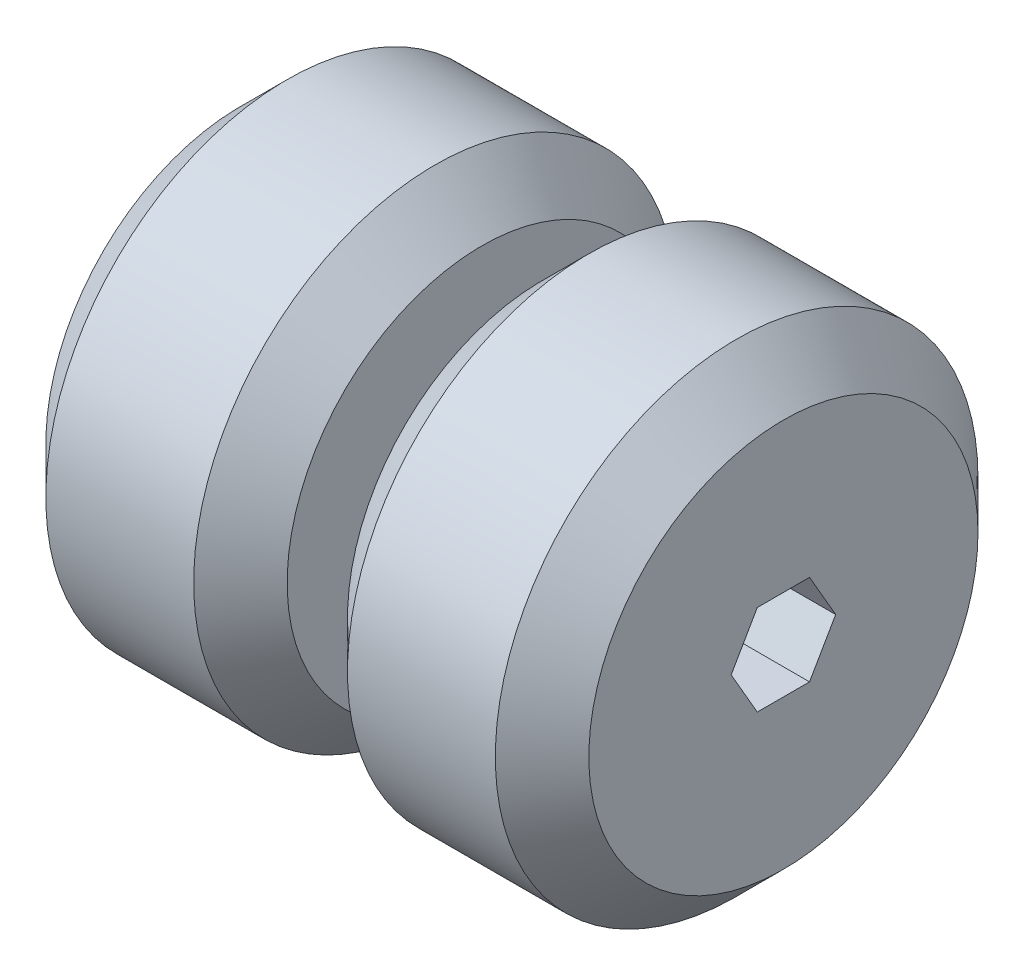
ISO-10303-21;
HEADER;
FILE_DESCRIPTION(('STEP AP214'),'2;1');
FILE_NAME('part.step','',(''),(''),'','','');
FILE_SCHEMA(('AUTOMOTIVE_DESIGN { 1 0 10303 214 1 1 1 1 }'));
ENDSEC;
DATA;
#1=APPLICATION_CONTEXT('core data for automotive mechanical design processes');
#2=APPLICATION_PROTOCOL_DEFINITION('international standard','automotive_design',2000,#1);
#3=PRODUCT_CONTEXT('',#1,'mechanical');
#4=PRODUCT('Part','Part','',(#3));
#5=PRODUCT_RELATED_PRODUCT_CATEGORY('part','',(#4));
#6=PRODUCT_DEFINITION_FORMATION('','',#4);
#7=PRODUCT_DEFINITION_CONTEXT('part definition',#1,'design');
#8=PRODUCT_DEFINITION('design','',#6,#7);
#9=PRODUCT_DEFINITION_SHAPE('','',#8);
#10=(LENGTH_UNIT() NAMED_UNIT(*) SI_UNIT(.MILLI.,.METRE.));
#11=(NAMED_UNIT(*) PLANE_ANGLE_UNIT() SI_UNIT($,.RADIAN.));
#12=(NAMED_UNIT(*) SI_UNIT($,.STERADIAN.) SOLID_ANGLE_UNIT());
#13=UNCERTAINTY_MEASURE_WITH_UNIT(LENGTH_MEASURE(1.E-05),#10,'distance_accuracy_value','');
#14=(GEOMETRIC_REPRESENTATION_CONTEXT(3) GLOBAL_UNCERTAINTY_ASSIGNED_CONTEXT((#13)) GLOBAL_UNIT_ASSIGNED_CONTEXT((#10,
#11,#12)) REPRESENTATION_CONTEXT('',''));
#15=CARTESIAN_POINT('',(0.,0.,0.));
#16=DIRECTION('',(0.,0.,1.));
#17=DIRECTION('',(1.,0.,0.));
#18=AXIS2_PLACEMENT_3D('',#15,#16,#17);
#19=CARTESIAN_POINT('',(-28.575,0.,0.));
#20=DIRECTION('',(1.,0.,0.));
#21=DIRECTION('',(0.,0.,-1.));
#22=AXIS2_PLACEMENT_3D('',#19,#20,#21);
#23=CYLINDRICAL_SURFACE('',#22,25.4);
#24=CARTESIAN_POINT('',(-8.09500000000002,0.,0.));
#25=DIRECTION('',(1.,0.,0.));
#26=DIRECTION('',(0.,0.,-1.));
#27=AXIS2_PLACEMENT_3D('',#24,#25,#26);
#28=CIRCLE('',#27,25.4);
#29=CARTESIAN_POINT('',(-8.09500000000002,0.,-25.4));
#30=VERTEX_POINT('',#29);
#31=EDGE_CURVE('E162',#30,#30,#28,.F.);
#32=ORIENTED_EDGE('',*,*,#31,.T.);
#33=EDGE_LOOP('',(#32));
#34=FACE_BOUND('',#33,.T.);
#35=CARTESIAN_POINT('',(-23.655,0.,0.));
#36=DIRECTION('',(1.,0.,0.));
#37=DIRECTION('',(0.,0.,-1.));
#38=AXIS2_PLACEMENT_3D('',#35,#36,#37);
#39=CIRCLE('',#38,25.4);
#40=CARTESIAN_POINT('',(-23.655,0.,-25.4));
#41=VERTEX_POINT('',#40);
#42=EDGE_CURVE('E160',#41,#41,#39,.T.);
#43=ORIENTED_EDGE('',*,*,#42,.T.);
#44=EDGE_LOOP('',(#43));
#45=FACE_BOUND('',#44,.T.);
#46=ADVANCED_FACE('F36',(#34,#45),#23,.T.);
#47=CARTESIAN_POINT('',(-28.575,0.,0.));
#48=DIRECTION('',(1.,0.,0.));
#49=DIRECTION('',(0.,0.,-1.));
#50=AXIS2_PLACEMENT_3D('',#47,#48,#49);
#51=PLANE('',#50);
#52=DIRECTION('',(0.,-0.866025403784439,-0.5));
#53=VECTOR('',#52,1.);
#54=CARTESIAN_POINT('',(-28.575,0.,5.49926131403119));
#55=LINE('',#54,#53);
#56=CARTESIAN_POINT('',(-28.575,0.,5.49926131403119));
#57=VERTEX_POINT('',#56);
#58=CARTESIAN_POINT('',(-28.575,-4.7625,2.74963065701559));
#59=VERTEX_POINT('',#58);
#60=EDGE_CURVE('E98',#57,#59,#55,.T.);
#61=ORIENTED_EDGE('',*,*,#60,.T.);
#62=DIRECTION('',(0.,0.,-1.));
#63=VECTOR('',#62,1.);
#64=CARTESIAN_POINT('',(-28.575,-4.7625,2.74963065701559));
#65=LINE('',#64,#63);
#66=CARTESIAN_POINT('',(-28.575,-4.7625,-2.74963065701559));
#67=VERTEX_POINT('',#66);
#68=EDGE_CURVE('E92',#59,#67,#65,.T.);
#69=ORIENTED_EDGE('',*,*,#68,.T.);
#70=DIRECTION('',(0.,0.866025403784439,-0.5));
#71=VECTOR('',#70,1.);
#72=CARTESIAN_POINT('',(-28.575,-4.7625,-2.74963065701559));
#73=LINE('',#72,#71);
#74=CARTESIAN_POINT('',(-28.575,0.,-5.49926131403118));
#75=VERTEX_POINT('',#74);
#76=EDGE_CURVE('E101',#67,#75,#73,.T.);
#77=ORIENTED_EDGE('',*,*,#76,.T.);
#78=DIRECTION('',(0.,0.866025403784438,0.5));
#79=VECTOR('',#78,1.);
#80=CARTESIAN_POINT('',(-28.575,0.,-5.49926131403118));
#81=LINE('',#80,#79);
#82=CARTESIAN_POINT('',(-28.575,4.7625,-2.74963065701559));
#83=VERTEX_POINT('',#82);
#84=EDGE_CURVE('E52',#75,#83,#81,.T.);
#85=ORIENTED_EDGE('',*,*,#84,.T.);
#86=DIRECTION('',(0.,0.,1.));
#87=VECTOR('',#86,1.);
#88=CARTESIAN_POINT('',(-28.575,4.7625,-2.74963065701559));
#89=LINE('',#88,#87);
#90=CARTESIAN_POINT('',(-28.575,4.7625,2.74963065701559));
#91=VERTEX_POINT('',#90);
#92=EDGE_CURVE('E116',#83,#91,#89,.T.);
#93=ORIENTED_EDGE('',*,*,#92,.T.);
#94=DIRECTION('',(0.,-0.866025403784439,0.5));
#95=VECTOR('',#94,1.);
#96=CARTESIAN_POINT('',(-28.575,4.7625,2.74963065701559));
#97=LINE('',#96,#95);
#98=EDGE_CURVE('E119',#91,#57,#97,.T.);
#99=ORIENTED_EDGE('',*,*,#98,.T.);
#100=EDGE_LOOP('',(#61,#69,#77,#85,#93,#99));
#101=FACE_BOUND('',#100,.T.);
#102=CARTESIAN_POINT('',(-28.575,0.,0.));
#103=DIRECTION('',(1.,0.,0.));
#104=DIRECTION('',(0.,0.,-1.));
#105=AXIS2_PLACEMENT_3D('',#102,#103,#104);
#106=CIRCLE('',#105,20.48);
#107=CARTESIAN_POINT('',(-28.575,0.,-20.48));
#108=VERTEX_POINT('',#107);
#109=EDGE_CURVE('E40',#108,#108,#106,.F.);
#110=ORIENTED_EDGE('',*,*,#109,.T.);
#111=EDGE_LOOP('',(#110));
#112=FACE_BOUND('',#111,.T.);
#113=ADVANCED_FACE('F105',(#101,#112),#51,.F.);
#114=CARTESIAN_POINT('',(-3.175,0.,0.));
#115=DIRECTION('',(1.,0.,0.));
#116=DIRECTION('',(0.,0.,-1.));
#117=AXIS2_PLACEMENT_3D('',#114,#115,#116);
#118=PLANE('',#117);
#119=CARTESIAN_POINT('',(-3.175,0.,0.));
#120=DIRECTION('',(1.,0.,0.));
#121=DIRECTION('',(0.,0.,-1.));
#122=AXIS2_PLACEMENT_3D('',#119,#120,#121);
#123=CIRCLE('',#122,9.525);
#124=CARTESIAN_POINT('',(-3.175,0.,-9.525));
#125=VERTEX_POINT('',#124);
#126=EDGE_CURVE('E11',#125,#125,#123,.T.);
#127=ORIENTED_EDGE('',*,*,#126,.F.);
#128=EDGE_LOOP('',(#127));
#129=FACE_BOUND('',#128,.T.);
#130=CARTESIAN_POINT('',(-3.175,0.,0.));
#131=DIRECTION('',(1.,0.,0.));
#132=DIRECTION('',(0.,0.,-1.));
#133=AXIS2_PLACEMENT_3D('',#130,#131,#132);
#134=CIRCLE('',#133,20.48);
#135=CARTESIAN_POINT('',(-3.175,0.,-20.48));
#136=VERTEX_POINT('',#135);
#137=EDGE_CURVE('E157',#136,#136,#134,.T.);
#138=ORIENTED_EDGE('',*,*,#137,.T.);
#139=EDGE_LOOP('',(#138));
#140=FACE_BOUND('',#139,.T.);
#141=ADVANCED_FACE('F180',(#129,#140),#118,.T.);
#142=CARTESIAN_POINT('',(-3.175,0.,0.));
#143=DIRECTION('',(-1.,0.,0.));
#144=DIRECTION('',(0.,0.,1.));
#145=AXIS2_PLACEMENT_3D('',#142,#143,#144);
#146=CONICAL_SURFACE('',#145,20.48,0.785398163397446);
#147=ORIENTED_EDGE('',*,*,#31,.F.);
#148=EDGE_LOOP('',(#147));
#149=FACE_BOUND('',#148,.T.);
#150=ORIENTED_EDGE('',*,*,#137,.F.);
#151=EDGE_LOOP('',(#150));
#152=FACE_BOUND('',#151,.T.);
#153=ADVANCED_FACE('F172',(#149,#152),#146,.T.);
#154=CARTESIAN_POINT('',(-23.655,0.,0.));
#155=DIRECTION('',(1.,0.,0.));
#156=DIRECTION('',(0.,0.,-1.));
#157=AXIS2_PLACEMENT_3D('',#154,#155,#156);
#158=CONICAL_SURFACE('',#157,25.4,0.78539816339745);
#159=ORIENTED_EDGE('',*,*,#109,.F.);
#160=EDGE_LOOP('',(#159));
#161=FACE_BOUND('',#160,.T.);
#162=ORIENTED_EDGE('',*,*,#42,.F.);
#163=EDGE_LOOP('',(#162));
#164=FACE_BOUND('',#163,.T.);
#165=ADVANCED_FACE('F38',(#161,#164),#158,.T.);
#166=CARTESIAN_POINT('',(30.1157683632075,0.,0.));
#167=DIRECTION('',(-1.,0.,0.));
#168=DIRECTION('',(0.,0.,1.));
#169=AXIS2_PLACEMENT_3D('',#166,#167,#168);
#170=CYLINDRICAL_SURFACE('',#169,9.525);
#171=ORIENTED_EDGE('',*,*,#126,.T.);
#172=EDGE_LOOP('',(#171));
#173=FACE_BOUND('',#172,.T.);
#174=CARTESIAN_POINT('',(3.175,0.,0.));
#175=DIRECTION('',(1.,0.,0.));
#176=DIRECTION('',(0.,0.,-1.));
#177=AXIS2_PLACEMENT_3D('',#174,#175,#176);
#178=CIRCLE('',#177,9.525);
#179=CARTESIAN_POINT('',(3.175,0.,-9.525));
#180=VERTEX_POINT('',#179);
#181=EDGE_CURVE('E153',#180,#180,#178,.T.);
#182=ORIENTED_EDGE('',*,*,#181,.F.);
#183=EDGE_LOOP('',(#182));
#184=FACE_BOUND('',#183,.T.);
#185=ADVANCED_FACE('F171',(#173,#184),#170,.T.);
#186=CARTESIAN_POINT('',(28.575,0.,0.));
#187=DIRECTION('',(-1.,0.,0.));
#188=DIRECTION('',(0.,0.,1.));
#189=AXIS2_PLACEMENT_3D('',#186,#187,#188);
#190=CYLINDRICAL_SURFACE('',#189,25.4);
#191=CARTESIAN_POINT('',(23.655,0.,0.));
#192=DIRECTION('',(1.,0.,0.));
#193=DIRECTION('',(0.,0.,-1.));
#194=AXIS2_PLACEMENT_3D('',#191,#192,#193);
#195=CIRCLE('',#194,25.4);
#196=CARTESIAN_POINT('',(23.655,0.,-25.4));
#197=VERTEX_POINT('',#196);
#198=EDGE_CURVE('E148',#197,#197,#195,.F.);
#199=ORIENTED_EDGE('',*,*,#198,.T.);
#200=EDGE_LOOP('',(#199));
#201=FACE_BOUND('',#200,.T.);
#202=CARTESIAN_POINT('',(8.09500000000001,0.,0.));
#203=DIRECTION('',(1.,0.,0.));
#204=DIRECTION('',(0.,0.,-1.));
#205=AXIS2_PLACEMENT_3D('',#202,#203,#204);
#206=CIRCLE('',#205,25.4);
#207=CARTESIAN_POINT('',(8.09500000000001,0.,-25.4));
#208=VERTEX_POINT('',#207);
#209=EDGE_CURVE('E145',#208,#208,#206,.T.);
#210=ORIENTED_EDGE('',*,*,#209,.T.);
#211=EDGE_LOOP('',(#210));
#212=FACE_BOUND('',#211,.T.);
#213=ADVANCED_FACE('F198',(#201,#212),#190,.T.);
#214=CARTESIAN_POINT('',(28.575,0.,0.));
#215=DIRECTION('',(1.,0.,0.));
#216=DIRECTION('',(0.,0.,-1.));
#217=AXIS2_PLACEMENT_3D('',#214,#215,#216);
#218=PLANE('',#217);
#219=DIRECTION('',(0.,0.,-1.));
#220=VECTOR('',#219,1.);
#221=CARTESIAN_POINT('',(28.575,-4.7625,2.74963065701559));
#222=LINE('',#221,#220);
#223=CARTESIAN_POINT('',(28.575,-4.7625,2.74963065701559));
#224=VERTEX_POINT('',#223);
#225=CARTESIAN_POINT('',(28.575,-4.7625,-2.74963065701559));
#226=VERTEX_POINT('',#225);
#227=EDGE_CURVE('E60',#224,#226,#222,.T.);
#228=ORIENTED_EDGE('',*,*,#227,.F.);
#229=DIRECTION('',(0.,-0.866025403784439,-0.5));
#230=VECTOR('',#229,1.);
#231=CARTESIAN_POINT('',(28.575,0.,5.49926131403119));
#232=LINE('',#231,#230);
#233=CARTESIAN_POINT('',(28.575,0.,5.49926131403119));
#234=VERTEX_POINT('',#233);
#235=EDGE_CURVE('E109',#234,#224,#232,.T.);
#236=ORIENTED_EDGE('',*,*,#235,.F.);
#237=DIRECTION('',(0.,-0.866025403784439,0.5));
#238=VECTOR('',#237,1.);
#239=CARTESIAN_POINT('',(28.575,4.7625,2.74963065701559));
#240=LINE('',#239,#238);
#241=CARTESIAN_POINT('',(28.575,4.7625,2.74963065701559));
#242=VERTEX_POINT('',#241);
#243=EDGE_CURVE('E112',#242,#234,#240,.T.);
#244=ORIENTED_EDGE('',*,*,#243,.F.);
#245=DIRECTION('',(0.,0.,1.));
#246=VECTOR('',#245,1.);
#247=CARTESIAN_POINT('',(28.575,4.7625,-2.74963065701559));
#248=LINE('',#247,#246);
#249=CARTESIAN_POINT('',(28.575,4.7625,-2.74963065701559));
#250=VERTEX_POINT('',#249);
#251=EDGE_CURVE('E128',#250,#242,#248,.T.);
#252=ORIENTED_EDGE('',*,*,#251,.F.);
#253=DIRECTION('',(0.,0.866025403784438,0.5));
#254=VECTOR('',#253,1.);
#255=CARTESIAN_POINT('',(28.575,0.,-5.49926131403118));
#256=LINE('',#255,#254);
#257=CARTESIAN_POINT('',(28.575,0.,-5.49926131403118));
#258=VERTEX_POINT('',#257);
#259=EDGE_CURVE('E125',#258,#250,#256,.T.);
#260=ORIENTED_EDGE('',*,*,#259,.F.);
#261=DIRECTION('',(0.,0.866025403784439,-0.5));
#262=VECTOR('',#261,1.);
#263=CARTESIAN_POINT('',(28.575,-4.7625,-2.74963065701559));
#264=LINE('',#263,#262);
#265=EDGE_CURVE('E123',#226,#258,#264,.T.);
#266=ORIENTED_EDGE('',*,*,#265,.F.);
#267=EDGE_LOOP('',(#228,#236,#244,#252,#260,#266));
#268=FACE_BOUND('',#267,.T.);
#269=CARTESIAN_POINT('',(28.575,0.,0.));
#270=DIRECTION('',(1.,0.,0.));
#271=DIRECTION('',(0.,0.,-1.));
#272=AXIS2_PLACEMENT_3D('',#269,#270,#271);
#273=CIRCLE('',#272,20.48);
#274=CARTESIAN_POINT('',(28.575,0.,-20.48));
#275=VERTEX_POINT('',#274);
#276=EDGE_CURVE('E135',#275,#275,#273,.T.);
#277=ORIENTED_EDGE('',*,*,#276,.T.);
#278=EDGE_LOOP('',(#277));
#279=FACE_BOUND('',#278,.T.);
#280=ADVANCED_FACE('F206',(#268,#279),#218,.T.);
#281=CARTESIAN_POINT('',(3.175,0.,0.));
#282=DIRECTION('',(1.,0.,0.));
#283=DIRECTION('',(0.,0.,-1.));
#284=AXIS2_PLACEMENT_3D('',#281,#282,#283);
#285=PLANE('',#284);
#286=ORIENTED_EDGE('',*,*,#181,.T.);
#287=EDGE_LOOP('',(#286));
#288=FACE_BOUND('',#287,.T.);
#289=CARTESIAN_POINT('',(3.175,0.,0.));
#290=DIRECTION('',(1.,0.,0.));
#291=DIRECTION('',(0.,0.,-1.));
#292=AXIS2_PLACEMENT_3D('',#289,#290,#291);
#293=CIRCLE('',#292,20.48);
#294=CARTESIAN_POINT('',(3.175,0.,-20.48));
#295=VERTEX_POINT('',#294);
#296=EDGE_CURVE('E151',#295,#295,#293,.F.);
#297=ORIENTED_EDGE('',*,*,#296,.T.);
#298=EDGE_LOOP('',(#297));
#299=FACE_BOUND('',#298,.T.);
#300=ADVANCED_FACE('F202',(#288,#299),#285,.F.);
#301=CARTESIAN_POINT('',(28.575,0.,0.));
#302=DIRECTION('',(-1.,0.,0.));
#303=DIRECTION('',(0.,0.,1.));
#304=AXIS2_PLACEMENT_3D('',#301,#302,#303);
#305=CONICAL_SURFACE('',#304,20.48,0.785398163397446);
#306=ORIENTED_EDGE('',*,*,#198,.F.);
#307=EDGE_LOOP('',(#306));
#308=FACE_BOUND('',#307,.T.);
#309=ORIENTED_EDGE('',*,*,#276,.F.);
#310=EDGE_LOOP('',(#309));
#311=FACE_BOUND('',#310,.T.);
#312=ADVANCED_FACE('F205',(#308,#311),#305,.T.);
#313=CARTESIAN_POINT('',(8.09500000000001,0.,0.));
#314=DIRECTION('',(1.,0.,0.));
#315=DIRECTION('',(0.,0.,-1.));
#316=AXIS2_PLACEMENT_3D('',#313,#314,#315);
#317=CONICAL_SURFACE('',#316,25.4,0.785398163397449);
#318=ORIENTED_EDGE('',*,*,#296,.F.);
#319=EDGE_LOOP('',(#318));
#320=FACE_BOUND('',#319,.T.);
#321=ORIENTED_EDGE('',*,*,#209,.F.);
#322=EDGE_LOOP('',(#321));
#323=FACE_BOUND('',#322,.T.);
#324=ADVANCED_FACE('F210',(#320,#323),#317,.T.);
#325=CARTESIAN_POINT('',(-28.575,-4.7625,2.74963065701559));
#326=DIRECTION('',(0.,-1.,0.));
#327=DIRECTION('',(0.,0.,-1.));
#328=AXIS2_PLACEMENT_3D('',#325,#326,#327);
#329=PLANE('',#328);
#330=ORIENTED_EDGE('',*,*,#227,.T.);
#331=DIRECTION('',(1.,0.,0.));
#332=VECTOR('',#331,1.);
#333=CARTESIAN_POINT('',(-28.575,-4.7625,-2.74963065701559));
#334=LINE('',#333,#332);
#335=EDGE_CURVE('E88',#67,#226,#334,.T.);
#336=ORIENTED_EDGE('',*,*,#335,.F.);
#337=ORIENTED_EDGE('',*,*,#68,.F.);
#338=DIRECTION('',(1.,0.,0.));
#339=VECTOR('',#338,1.);
#340=CARTESIAN_POINT('',(-28.575,-4.7625,2.74963065701559));
#341=LINE('',#340,#339);
#342=EDGE_CURVE('E133',#59,#224,#341,.T.);
#343=ORIENTED_EDGE('',*,*,#342,.T.);
#344=EDGE_LOOP('',(#330,#336,#337,#343));
#345=FACE_BOUND('',#344,.T.);
#346=ADVANCED_FACE('F90',(#345),#329,.F.);
#347=CARTESIAN_POINT('',(-28.575,0.,5.49926131403119));
#348=DIRECTION('',(0.,-0.5,0.866025403784438));
#349=DIRECTION('',(0.,-0.866025403784439,-0.5));
#350=AXIS2_PLACEMENT_3D('',#347,#348,#349);
#351=PLANE('',#350);
#352=ORIENTED_EDGE('',*,*,#235,.T.);
#353=ORIENTED_EDGE('',*,*,#342,.F.);
#354=ORIENTED_EDGE('',*,*,#60,.F.);
#355=DIRECTION('',(1.,0.,0.));
#356=VECTOR('',#355,1.);
#357=CARTESIAN_POINT('',(-28.575,0.,5.49926131403119));
#358=LINE('',#357,#356);
#359=EDGE_CURVE('E136',#57,#234,#358,.T.);
#360=ORIENTED_EDGE('',*,*,#359,.T.);
#361=EDGE_LOOP('',(#352,#353,#354,#360));
#362=FACE_BOUND('',#361,.T.);
#363=ADVANCED_FACE('F246',(#362),#351,.F.);
#364=CARTESIAN_POINT('',(-28.575,4.7625,2.74963065701559));
#365=DIRECTION('',(0.,0.5,0.866025403784439));
#366=DIRECTION('',(0.,-0.866025403784439,0.5));
#367=AXIS2_PLACEMENT_3D('',#364,#365,#366);
#368=PLANE('',#367);
#369=ORIENTED_EDGE('',*,*,#243,.T.);
#370=ORIENTED_EDGE('',*,*,#359,.F.);
#371=ORIENTED_EDGE('',*,*,#98,.F.);
#372=DIRECTION('',(1.,0.,0.));
#373=VECTOR('',#372,1.);
#374=CARTESIAN_POINT('',(-28.575,4.7625,2.74963065701559));
#375=LINE('',#374,#373);
#376=EDGE_CURVE('E138',#91,#242,#375,.T.);
#377=ORIENTED_EDGE('',*,*,#376,.T.);
#378=EDGE_LOOP('',(#369,#370,#371,#377));
#379=FACE_BOUND('',#378,.T.);
#380=ADVANCED_FACE('F254',(#379),#368,.F.);
#381=CARTESIAN_POINT('',(-28.575,4.7625,-2.74963065701559));
#382=DIRECTION('',(0.,1.,0.));
#383=DIRECTION('',(0.,0.,1.));
#384=AXIS2_PLACEMENT_3D('',#381,#382,#383);
#385=PLANE('',#384);
#386=ORIENTED_EDGE('',*,*,#251,.T.);
#387=ORIENTED_EDGE('',*,*,#376,.F.);
#388=ORIENTED_EDGE('',*,*,#92,.F.);
#389=DIRECTION('',(1.,0.,0.));
#390=VECTOR('',#389,1.);
#391=CARTESIAN_POINT('',(-28.575,4.7625,-2.74963065701559));
#392=LINE('',#391,#390);
#393=EDGE_CURVE('E140',#83,#250,#392,.T.);
#394=ORIENTED_EDGE('',*,*,#393,.T.);
#395=EDGE_LOOP('',(#386,#387,#388,#394));
#396=FACE_BOUND('',#395,.T.);
#397=ADVANCED_FACE('F262',(#396),#385,.F.);
#398=CARTESIAN_POINT('',(-28.575,0.,-5.49926131403118));
#399=DIRECTION('',(0.,0.5,-0.866025403784438));
#400=DIRECTION('',(0.,0.866025403784439,0.5));
#401=AXIS2_PLACEMENT_3D('',#398,#399,#400);
#402=PLANE('',#401);
#403=ORIENTED_EDGE('',*,*,#259,.T.);
#404=ORIENTED_EDGE('',*,*,#393,.F.);
#405=ORIENTED_EDGE('',*,*,#84,.F.);
#406=DIRECTION('',(1.,0.,0.));
#407=VECTOR('',#406,1.);
#408=CARTESIAN_POINT('',(-28.575,0.,-5.49926131403118));
#409=LINE('',#408,#407);
#410=EDGE_CURVE('E97',#75,#258,#409,.T.);
#411=ORIENTED_EDGE('',*,*,#410,.T.);
#412=EDGE_LOOP('',(#403,#404,#405,#411));
#413=FACE_BOUND('',#412,.T.);
#414=ADVANCED_FACE('F270',(#413),#402,.F.);
#415=CARTESIAN_POINT('',(-28.575,-4.7625,-2.74963065701559));
#416=DIRECTION('',(0.,-0.5,-0.866025403784439));
#417=DIRECTION('',(0.,0.866025403784439,-0.5));
#418=AXIS2_PLACEMENT_3D('',#415,#416,#417);
#419=PLANE('',#418);
#420=ORIENTED_EDGE('',*,*,#265,.T.);
#421=ORIENTED_EDGE('',*,*,#410,.F.);
#422=ORIENTED_EDGE('',*,*,#76,.F.);
#423=ORIENTED_EDGE('',*,*,#335,.T.);
#424=EDGE_LOOP('',(#420,#421,#422,#423));
#425=FACE_BOUND('',#424,.T.);
#426=ADVANCED_FACE('F102',(#425),#419,.F.);
#427=CLOSED_SHELL('',(#46,#113,#141,#153,#165,#185,#213,#280,#300,#312,#324,#346,#363,#380,#397,
#414,#426));
#428=MANIFOLD_SOLID_BREP('B2',#427);
#429=ADVANCED_BREP_SHAPE_REPRESENTATION('',(#18,#428),#14);
#430=SHAPE_DEFINITION_REPRESENTATION(#9,#429);
ENDSEC;
END-ISO-10303-21;
